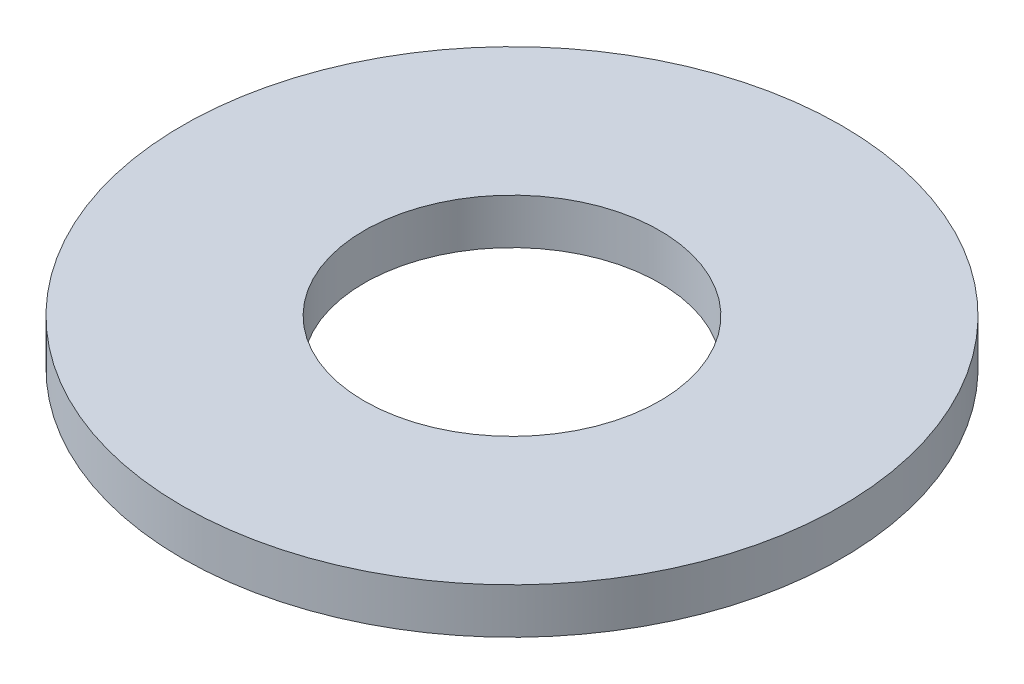
ISO-10303-21;
HEADER;
FILE_DESCRIPTION(('STEP AP214'),'2;1');
FILE_NAME('part.step','',(''),(''),'','','');
FILE_SCHEMA(('AUTOMOTIVE_DESIGN { 1 0 10303 214 1 1 1 1 }'));
ENDSEC;
DATA;
#1=APPLICATION_CONTEXT('core data for automotive mechanical design processes');
#2=APPLICATION_PROTOCOL_DEFINITION('international standard','automotive_design',2000,#1);
#3=PRODUCT_CONTEXT('',#1,'mechanical');
#4=PRODUCT('Part','Part','',(#3));
#5=PRODUCT_RELATED_PRODUCT_CATEGORY('part','',(#4));
#6=PRODUCT_DEFINITION_FORMATION('','',#4);
#7=PRODUCT_DEFINITION_CONTEXT('part definition',#1,'design');
#8=PRODUCT_DEFINITION('design','',#6,#7);
#9=PRODUCT_DEFINITION_SHAPE('','',#8);
#10=(LENGTH_UNIT() NAMED_UNIT(*) SI_UNIT(.MILLI.,.METRE.));
#11=(NAMED_UNIT(*) PLANE_ANGLE_UNIT() SI_UNIT($,.RADIAN.));
#12=(NAMED_UNIT(*) SI_UNIT($,.STERADIAN.) SOLID_ANGLE_UNIT());
#13=UNCERTAINTY_MEASURE_WITH_UNIT(LENGTH_MEASURE(1.E-05),#10,'distance_accuracy_value','');
#14=(GEOMETRIC_REPRESENTATION_CONTEXT(3) GLOBAL_UNCERTAINTY_ASSIGNED_CONTEXT((#13)) GLOBAL_UNIT_ASSIGNED_CONTEXT((#10,
#11,#12)) REPRESENTATION_CONTEXT('',''));
#15=CARTESIAN_POINT('',(0.,0.,0.));
#16=DIRECTION('',(0.,0.,1.));
#17=DIRECTION('',(1.,0.,0.));
#18=AXIS2_PLACEMENT_3D('',#15,#16,#17);
#19=CARTESIAN_POINT('',(0.,10.,0.));
#20=DIRECTION('',(0.,-1.,0.));
#21=DIRECTION('',(0.,0.,-1.));
#22=AXIS2_PLACEMENT_3D('',#19,#20,#21);
#23=CYLINDRICAL_SURFACE('',#22,72.5);
#24=CARTESIAN_POINT('',(0.,10.,0.));
#25=DIRECTION('',(0.,1.,0.));
#26=DIRECTION('',(0.,0.,1.));
#27=AXIS2_PLACEMENT_3D('',#24,#25,#26);
#28=CIRCLE('',#27,72.5);
#29=CARTESIAN_POINT('',(0.,10.,72.5));
#30=VERTEX_POINT('',#29);
#31=EDGE_CURVE('E10',#30,#30,#28,.T.);
#32=ORIENTED_EDGE('',*,*,#31,.F.);
#33=EDGE_LOOP('',(#32));
#34=FACE_BOUND('',#33,.T.);
#35=CARTESIAN_POINT('',(0.,0.,0.));
#36=DIRECTION('',(0.,1.,0.));
#37=DIRECTION('',(0.,0.,1.));
#38=AXIS2_PLACEMENT_3D('',#35,#36,#37);
#39=CIRCLE('',#38,72.5);
#40=CARTESIAN_POINT('',(0.,0.,72.5));
#41=VERTEX_POINT('',#40);
#42=EDGE_CURVE('E37',#41,#41,#39,.T.);
#43=ORIENTED_EDGE('',*,*,#42,.T.);
#44=EDGE_LOOP('',(#43));
#45=FACE_BOUND('',#44,.T.);
#46=ADVANCED_FACE('F40',(#34,#45),#23,.T.);
#47=CARTESIAN_POINT('',(0.,10.,0.));
#48=DIRECTION('',(0.,1.,0.));
#49=DIRECTION('',(0.,0.,1.));
#50=AXIS2_PLACEMENT_3D('',#47,#48,#49);
#51=PLANE('',#50);
#52=CARTESIAN_POINT('',(0.,10.,0.));
#53=DIRECTION('',(0.,1.,0.));
#54=DIRECTION('',(0.,0.,1.));
#55=AXIS2_PLACEMENT_3D('',#52,#53,#54);
#56=CIRCLE('',#55,32.5);
#57=CARTESIAN_POINT('',(0.,10.,32.5));
#58=VERTEX_POINT('',#57);
#59=EDGE_CURVE('E50',#58,#58,#56,.T.);
#60=ORIENTED_EDGE('',*,*,#59,.F.);
#61=EDGE_LOOP('',(#60));
#62=FACE_BOUND('',#61,.T.);
#63=ORIENTED_EDGE('',*,*,#31,.T.);
#64=EDGE_LOOP('',(#63));
#65=FACE_BOUND('',#64,.T.);
#66=ADVANCED_FACE('F59',(#62,#65),#51,.T.);
#67=CARTESIAN_POINT('',(0.,0.,0.));
#68=DIRECTION('',(0.,1.,0.));
#69=DIRECTION('',(0.,0.,1.));
#70=AXIS2_PLACEMENT_3D('',#67,#68,#69);
#71=PLANE('',#70);
#72=CARTESIAN_POINT('',(0.,0.,0.));
#73=DIRECTION('',(0.,1.,0.));
#74=DIRECTION('',(0.,0.,1.));
#75=AXIS2_PLACEMENT_3D('',#72,#73,#74);
#76=CIRCLE('',#75,32.5);
#77=CARTESIAN_POINT('',(0.,0.,32.5));
#78=VERTEX_POINT('',#77);
#79=EDGE_CURVE('E47',#78,#78,#76,.T.);
#80=ORIENTED_EDGE('',*,*,#79,.T.);
#81=EDGE_LOOP('',(#80));
#82=FACE_BOUND('',#81,.T.);
#83=ORIENTED_EDGE('',*,*,#42,.F.);
#84=EDGE_LOOP('',(#83));
#85=FACE_BOUND('',#84,.T.);
#86=ADVANCED_FACE('F58',(#82,#85),#71,.F.);
#87=CARTESIAN_POINT('',(0.,10.,0.));
#88=DIRECTION('',(0.,-1.,0.));
#89=DIRECTION('',(0.,0.,-1.));
#90=AXIS2_PLACEMENT_3D('',#87,#88,#89);
#91=CYLINDRICAL_SURFACE('',#90,32.5);
#92=ORIENTED_EDGE('',*,*,#59,.T.);
#93=EDGE_LOOP('',(#92));
#94=FACE_BOUND('',#93,.T.);
#95=ORIENTED_EDGE('',*,*,#79,.F.);
#96=EDGE_LOOP('',(#95));
#97=FACE_BOUND('',#96,.T.);
#98=ADVANCED_FACE('F54',(#94,#97),#91,.F.);
#99=CLOSED_SHELL('',(#46,#66,#86,#98));
#100=MANIFOLD_SOLID_BREP('B2',#99);
#101=ADVANCED_BREP_SHAPE_REPRESENTATION('',(#18,#100),#14);
#102=SHAPE_DEFINITION_REPRESENTATION(#9,#101);
ENDSEC;
END-ISO-10303-21;
